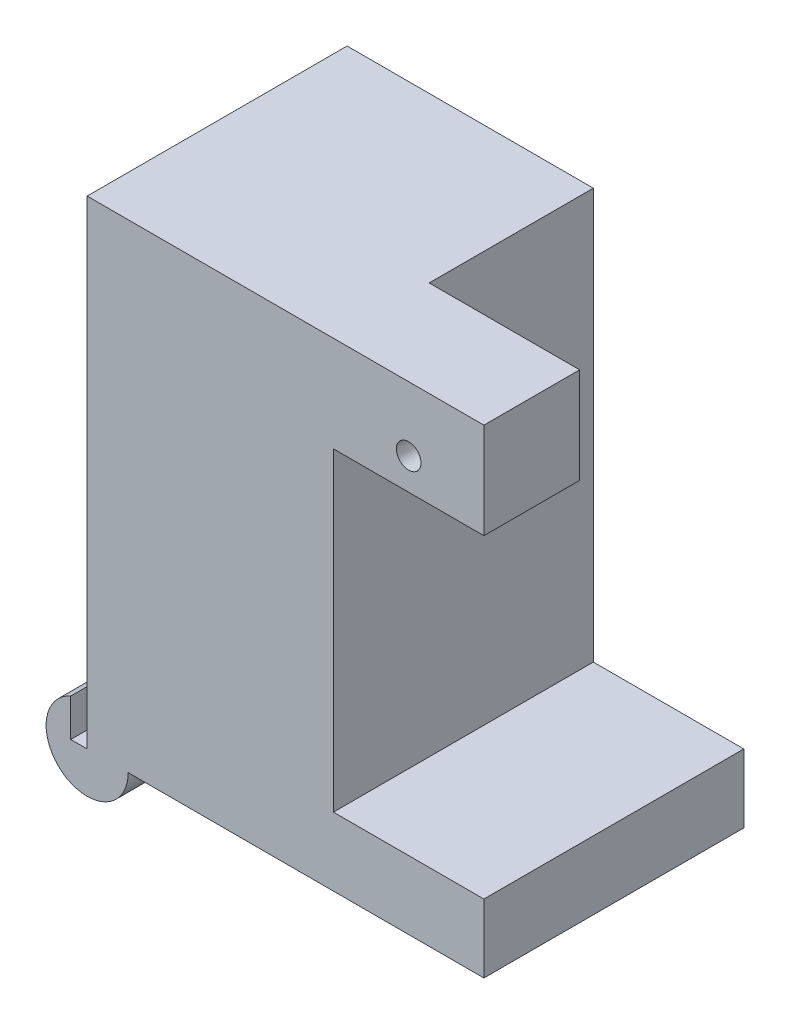
ISO-10303-21;
HEADER;
FILE_DESCRIPTION(('STEP AP214'),'2;1');
FILE_NAME('part.step','',(''),(''),'','','');
FILE_SCHEMA(('AUTOMOTIVE_DESIGN { 1 0 10303 214 1 1 1 1 }'));
ENDSEC;
DATA;
#1=APPLICATION_CONTEXT('core data for automotive mechanical design processes');
#2=APPLICATION_PROTOCOL_DEFINITION('international standard','automotive_design',2000,#1);
#3=PRODUCT_CONTEXT('',#1,'mechanical');
#4=PRODUCT('Part','Part','',(#3));
#5=PRODUCT_RELATED_PRODUCT_CATEGORY('part','',(#4));
#6=PRODUCT_DEFINITION_FORMATION('','',#4);
#7=PRODUCT_DEFINITION_CONTEXT('part definition',#1,'design');
#8=PRODUCT_DEFINITION('design','',#6,#7);
#9=PRODUCT_DEFINITION_SHAPE('','',#8);
#10=(LENGTH_UNIT() NAMED_UNIT(*) SI_UNIT(.MILLI.,.METRE.));
#11=(NAMED_UNIT(*) PLANE_ANGLE_UNIT() SI_UNIT($,.RADIAN.));
#12=(NAMED_UNIT(*) SI_UNIT($,.STERADIAN.) SOLID_ANGLE_UNIT());
#13=UNCERTAINTY_MEASURE_WITH_UNIT(LENGTH_MEASURE(1.E-05),#10,'distance_accuracy_value','');
#14=(GEOMETRIC_REPRESENTATION_CONTEXT(3) GLOBAL_UNCERTAINTY_ASSIGNED_CONTEXT((#13)) GLOBAL_UNIT_ASSIGNED_CONTEXT((#10,
#11,#12)) REPRESENTATION_CONTEXT('',''));
#15=CARTESIAN_POINT('',(0.,0.,0.));
#16=DIRECTION('',(0.,0.,1.));
#17=DIRECTION('',(1.,0.,0.));
#18=AXIS2_PLACEMENT_3D('',#15,#16,#17);
#19=CARTESIAN_POINT('',(-10.3061538100993,0.,-7.94382972657588));
#20=DIRECTION('',(0.,0.,-1.));
#21=DIRECTION('',(-1.,0.,0.));
#22=AXIS2_PLACEMENT_3D('',#19,#20,#21);
#23=CYLINDRICAL_SURFACE('',#22,3.);
#24=DIRECTION('',(0.,0.,-1.));
#25=VECTOR('',#24,1.);
#26=CARTESIAN_POINT('',(-11.5061538100993,2.7495454169735,-7.94382972657588));
#27=LINE('',#26,#25);
#28=CARTESIAN_POINT('',(-11.5061538100993,2.74954541697351,-1.94382972657588));
#29=VERTEX_POINT('',#28);
#30=CARTESIAN_POINT('',(-11.5061538100993,2.7495454169735,11.0561702734241));
#31=VERTEX_POINT('',#30);
#32=EDGE_CURVE('E136',#29,#31,#27,.F.);
#33=ORIENTED_EDGE('',*,*,#32,.F.);
#34=CARTESIAN_POINT('',(-10.3061538100993,0.,-1.94382972657588));
#35=DIRECTION('',(0.,0.,-1.));
#36=DIRECTION('',(-1.,0.,0.));
#37=AXIS2_PLACEMENT_3D('',#34,#35,#36);
#38=CIRCLE('',#37,3.);
#39=CARTESIAN_POINT('',(-7.30615381009931,0.,-1.94382972657588));
#40=VERTEX_POINT('',#39);
#41=EDGE_CURVE('E243',#29,#40,#38,.F.);
#42=ORIENTED_EDGE('',*,*,#41,.T.);
#43=DIRECTION('',(0.,0.,-1.));
#44=VECTOR('',#43,1.);
#45=CARTESIAN_POINT('',(-7.30615381009931,0.,-7.94382972657588));
#46=LINE('',#45,#44);
#47=CARTESIAN_POINT('',(-7.30615381009931,0.,11.0561702734241));
#48=VERTEX_POINT('',#47);
#49=EDGE_CURVE('E241',#48,#40,#46,.T.);
#50=ORIENTED_EDGE('',*,*,#49,.F.);
#51=CARTESIAN_POINT('',(-10.3061538100993,0.,11.0561702734241));
#52=DIRECTION('',(0.,0.,-1.));
#53=DIRECTION('',(-1.,0.,0.));
#54=AXIS2_PLACEMENT_3D('',#51,#52,#53);
#55=CIRCLE('',#54,3.);
#56=EDGE_CURVE('E157',#48,#31,#55,.T.);
#57=ORIENTED_EDGE('',*,*,#56,.T.);
#58=EDGE_LOOP('',(#33,#42,#50,#57));
#59=FACE_BOUND('',#58,.T.);
#60=ADVANCED_FACE('F33',(#59),#23,.T.);
#61=CARTESIAN_POINT('',(-10.3061538100993,35.,-7.94382972657588));
#62=DIRECTION('',(0.,0.,1.));
#63=DIRECTION('',(1.,0.,0.));
#64=AXIS2_PLACEMENT_3D('',#61,#62,#63);
#65=PLANE('',#64);
#66=DIRECTION('',(-1.,0.,0.));
#67=VECTOR('',#66,1.);
#68=CARTESIAN_POINT('',(-10.3061538100993,0.,-7.94382972657588));
#69=LINE('',#68,#67);
#70=CARTESIAN_POINT('',(18.6938461899007,0.,-7.94382972657588));
#71=VERTEX_POINT('',#70);
#72=CARTESIAN_POINT('',(-10.3061538100993,0.,-7.94382972657587));
#73=VERTEX_POINT('',#72);
#74=EDGE_CURVE('E225',#71,#73,#69,.T.);
#75=ORIENTED_EDGE('',*,*,#74,.T.);
#76=DIRECTION('',(0.,-1.,0.));
#77=VECTOR('',#76,1.);
#78=CARTESIAN_POINT('',(-10.3061538100993,35.,-7.94382972657588));
#79=LINE('',#78,#77);
#80=CARTESIAN_POINT('',(-10.3061538100993,35.,-7.94382972657588));
#81=VERTEX_POINT('',#80);
#82=EDGE_CURVE('E218',#81,#73,#79,.T.);
#83=ORIENTED_EDGE('',*,*,#82,.F.);
#84=DIRECTION('',(-1.,0.,0.));
#85=VECTOR('',#84,1.);
#86=CARTESIAN_POINT('',(-10.3061538100993,35.,-7.94382972657588));
#87=LINE('',#86,#85);
#88=CARTESIAN_POINT('',(7.69384618990069,35.,-7.94382972657588));
#89=VERTEX_POINT('',#88);
#90=EDGE_CURVE('E224',#89,#81,#87,.T.);
#91=ORIENTED_EDGE('',*,*,#90,.F.);
#92=DIRECTION('',(0.,-1.,0.));
#93=VECTOR('',#92,1.);
#94=CARTESIAN_POINT('',(7.69384618990069,35.,-7.94382972657588));
#95=LINE('',#94,#93);
#96=CARTESIAN_POINT('',(7.69384618990069,5.,-7.94382972657588));
#97=VERTEX_POINT('',#96);
#98=EDGE_CURVE('E214',#89,#97,#95,.T.);
#99=ORIENTED_EDGE('',*,*,#98,.T.);
#100=DIRECTION('',(-1.,0.,0.));
#101=VECTOR('',#100,1.);
#102=CARTESIAN_POINT('',(18.6938461899007,5.,-7.94382972657588));
#103=LINE('',#102,#101);
#104=CARTESIAN_POINT('',(18.6938461899007,5.,-7.94382972657588));
#105=VERTEX_POINT('',#104);
#106=EDGE_CURVE('E206',#105,#97,#103,.T.);
#107=ORIENTED_EDGE('',*,*,#106,.F.);
#108=DIRECTION('',(0.,1.,0.));
#109=VECTOR('',#108,1.);
#110=CARTESIAN_POINT('',(18.6938461899007,0.,-7.94382972657588));
#111=LINE('',#110,#109);
#112=EDGE_CURVE('E184',#71,#105,#111,.T.);
#113=ORIENTED_EDGE('',*,*,#112,.F.);
#114=EDGE_LOOP('',(#75,#83,#91,#99,#107,#113));
#115=FACE_BOUND('',#114,.T.);
#116=ADVANCED_FACE('F264',(#115),#65,.F.);
#117=CARTESIAN_POINT('',(0.,0.,0.));
#118=DIRECTION('',(0.,1.,0.));
#119=DIRECTION('',(0.,0.,1.));
#120=AXIS2_PLACEMENT_3D('',#117,#118,#119);
#121=PLANE('',#120);
#122=DIRECTION('',(0.,0.,1.));
#123=VECTOR('',#122,1.);
#124=CARTESIAN_POINT('',(-10.3061538100993,0.,-7.94382972657587));
#125=LINE('',#124,#123);
#126=CARTESIAN_POINT('',(-10.3061538100993,0.,-1.94382972657588));
#127=VERTEX_POINT('',#126);
#128=EDGE_CURVE('E151',#73,#127,#125,.T.);
#129=ORIENTED_EDGE('',*,*,#128,.F.);
#130=ORIENTED_EDGE('',*,*,#74,.F.);
#131=DIRECTION('',(0.,0.,-1.));
#132=VECTOR('',#131,1.);
#133=CARTESIAN_POINT('',(18.6938461899007,0.,-7.94382972657588));
#134=LINE('',#133,#132);
#135=CARTESIAN_POINT('',(18.6938461899007,0.,11.0561702734241));
#136=VERTEX_POINT('',#135);
#137=EDGE_CURVE('E192',#136,#71,#134,.T.);
#138=ORIENTED_EDGE('',*,*,#137,.F.);
#139=DIRECTION('',(1.,0.,0.));
#140=VECTOR('',#139,1.);
#141=CARTESIAN_POINT('',(-10.3061538100993,0.,11.0561702734241));
#142=LINE('',#141,#140);
#143=EDGE_CURVE('E211',#48,#136,#142,.T.);
#144=ORIENTED_EDGE('',*,*,#143,.F.);
#145=ORIENTED_EDGE('',*,*,#49,.T.);
#146=DIRECTION('',(-1.,0.,0.));
#147=VECTOR('',#146,1.);
#148=CARTESIAN_POINT('',(18.6938461899007,0.,-1.94382972657588));
#149=LINE('',#148,#147);
#150=EDGE_CURVE('E154',#40,#127,#149,.T.);
#151=ORIENTED_EDGE('',*,*,#150,.T.);
#152=EDGE_LOOP('',(#129,#130,#138,#144,#145,#151));
#153=FACE_BOUND('',#152,.T.);
#154=ADVANCED_FACE('F261',(#153),#121,.F.);
#155=CARTESIAN_POINT('',(7.69384618990069,35.,-7.94382972657588));
#156=DIRECTION('',(-1.,0.,0.));
#157=DIRECTION('',(0.,0.,1.));
#158=AXIS2_PLACEMENT_3D('',#155,#156,#157);
#159=PLANE('',#158);
#160=DIRECTION('',(0.,0.,-1.));
#161=VECTOR('',#160,1.);
#162=CARTESIAN_POINT('',(7.69384618990069,28.,11.0561702734241));
#163=LINE('',#162,#161);
#164=CARTESIAN_POINT('',(7.69384618990069,28.,11.0561702734241));
#165=VERTEX_POINT('',#164);
#166=CARTESIAN_POINT('',(7.69384618990069,28.,4.05617027342412));
#167=VERTEX_POINT('',#166);
#168=EDGE_CURVE('E170',#165,#167,#163,.T.);
#169=ORIENTED_EDGE('',*,*,#168,.F.);
#170=DIRECTION('',(0.,-1.,0.));
#171=VECTOR('',#170,1.);
#172=CARTESIAN_POINT('',(7.69384618990069,35.,11.0561702734241));
#173=LINE('',#172,#171);
#174=CARTESIAN_POINT('',(7.69384618990069,5.,11.0561702734241));
#175=VERTEX_POINT('',#174);
#176=EDGE_CURVE('E217',#165,#175,#173,.T.);
#177=ORIENTED_EDGE('',*,*,#176,.T.);
#178=DIRECTION('',(0.,0.,1.));
#179=VECTOR('',#178,1.);
#180=CARTESIAN_POINT('',(7.69384618990069,5.,-7.94382972657588));
#181=LINE('',#180,#179);
#182=EDGE_CURVE('E183',#97,#175,#181,.T.);
#183=ORIENTED_EDGE('',*,*,#182,.F.);
#184=ORIENTED_EDGE('',*,*,#98,.F.);
#185=DIRECTION('',(0.,0.,1.));
#186=VECTOR('',#185,1.);
#187=CARTESIAN_POINT('',(7.69384618990069,35.,4.05617027342412));
#188=LINE('',#187,#186);
#189=CARTESIAN_POINT('',(7.69384618990069,35.,4.05617027342413));
#190=VERTEX_POINT('',#189);
#191=EDGE_CURVE('E161',#89,#190,#188,.T.);
#192=ORIENTED_EDGE('',*,*,#191,.T.);
#193=DIRECTION('',(0.,-1.,0.));
#194=VECTOR('',#193,1.);
#195=CARTESIAN_POINT('',(7.69384618990069,35.,4.05617027342412));
#196=LINE('',#195,#194);
#197=EDGE_CURVE('E162',#190,#167,#196,.T.);
#198=ORIENTED_EDGE('',*,*,#197,.T.);
#199=EDGE_LOOP('',(#169,#177,#183,#184,#192,#198));
#200=FACE_BOUND('',#199,.T.);
#201=ADVANCED_FACE('F248',(#200),#159,.F.);
#202=CARTESIAN_POINT('',(-10.3061538100993,35.,-7.94382972657588));
#203=DIRECTION('',(1.,0.,0.));
#204=DIRECTION('',(0.,0.,-1.));
#205=AXIS2_PLACEMENT_3D('',#202,#203,#204);
#206=PLANE('',#205);
#207=CARTESIAN_POINT('',(-10.3061538100993,4.,-3.94382972657588));
#208=DIRECTION('',(-1.,0.,0.));
#209=DIRECTION('',(0.,0.,1.));
#210=AXIS2_PLACEMENT_3D('',#207,#208,#209);
#211=CIRCLE('',#210,1.4);
#212=CARTESIAN_POINT('',(-10.3061538100993,4.,-2.54382972657588));
#213=VERTEX_POINT('',#212);
#214=EDGE_CURVE('E299',#213,#213,#211,.T.);
#215=ORIENTED_EDGE('',*,*,#214,.F.);
#216=EDGE_LOOP('',(#215));
#217=FACE_BOUND('',#216,.T.);
#218=DIRECTION('',(0.,0.,1.));
#219=VECTOR('',#218,1.);
#220=CARTESIAN_POINT('',(-10.3061538100993,0.,11.0561702734241));
#221=LINE('',#220,#219);
#222=CARTESIAN_POINT('',(-10.3061538100993,0.,11.0561702734241));
#223=VERTEX_POINT('',#222);
#224=EDGE_CURVE('E49',#127,#223,#221,.T.);
#225=ORIENTED_EDGE('',*,*,#224,.T.);
#226=DIRECTION('',(0.,-1.,0.));
#227=VECTOR('',#226,1.);
#228=CARTESIAN_POINT('',(-10.3061538100993,35.,11.0561702734241));
#229=LINE('',#228,#227);
#230=CARTESIAN_POINT('',(-10.3061538100993,35.,11.0561702734241));
#231=VERTEX_POINT('',#230);
#232=EDGE_CURVE('E145',#231,#223,#229,.T.);
#233=ORIENTED_EDGE('',*,*,#232,.F.);
#234=DIRECTION('',(0.,0.,1.));
#235=VECTOR('',#234,1.);
#236=CARTESIAN_POINT('',(-10.3061538100993,35.,-7.94382972657588));
#237=LINE('',#236,#235);
#238=EDGE_CURVE('E197',#81,#231,#237,.T.);
#239=ORIENTED_EDGE('',*,*,#238,.F.);
#240=ORIENTED_EDGE('',*,*,#82,.T.);
#241=ORIENTED_EDGE('',*,*,#128,.T.);
#242=EDGE_LOOP('',(#225,#233,#239,#240,#241));
#243=FACE_BOUND('',#242,.T.);
#244=ADVANCED_FACE('F35',(#217,#243),#206,.F.);
#245=CARTESIAN_POINT('',(-10.3061538100993,35.,11.0561702734241));
#246=DIRECTION('',(0.,0.,-1.));
#247=DIRECTION('',(-1.,0.,0.));
#248=AXIS2_PLACEMENT_3D('',#245,#246,#247);
#249=PLANE('',#248);
#250=CARTESIAN_POINT('',(13.1938461899007,30.3,11.0561702734241));
#251=DIRECTION('',(0.,0.,1.));
#252=DIRECTION('',(1.,0.,0.));
#253=AXIS2_PLACEMENT_3D('',#250,#251,#252);
#254=CIRCLE('',#253,0.900000000000002);
#255=CARTESIAN_POINT('',(14.0938461899007,30.3,11.0561702734241));
#256=VERTEX_POINT('',#255);
#257=EDGE_CURVE('E300',#256,#256,#254,.T.);
#258=ORIENTED_EDGE('',*,*,#257,.F.);
#259=EDGE_LOOP('',(#258));
#260=FACE_BOUND('',#259,.T.);
#261=ORIENTED_EDGE('',*,*,#232,.T.);
#262=DIRECTION('',(-1.,0.,0.));
#263=VECTOR('',#262,1.);
#264=CARTESIAN_POINT('',(-10.3061538100993,0.,11.0561702734241));
#265=LINE('',#264,#263);
#266=CARTESIAN_POINT('',(-11.5061538100993,0.,11.0561702734241));
#267=VERTEX_POINT('',#266);
#268=EDGE_CURVE('E128',#223,#267,#265,.T.);
#269=ORIENTED_EDGE('',*,*,#268,.T.);
#270=DIRECTION('',(0.,1.,0.));
#271=VECTOR('',#270,1.);
#272=CARTESIAN_POINT('',(-11.5061538100993,-19.0378570222596,11.0561702734241));
#273=LINE('',#272,#271);
#274=EDGE_CURVE('E131',#267,#31,#273,.T.);
#275=ORIENTED_EDGE('',*,*,#274,.T.);
#276=ORIENTED_EDGE('',*,*,#56,.F.);
#277=ORIENTED_EDGE('',*,*,#143,.T.);
#278=DIRECTION('',(0.,-1.,0.));
#279=VECTOR('',#278,1.);
#280=CARTESIAN_POINT('',(18.6938461899007,0.,11.0561702734241));
#281=LINE('',#280,#279);
#282=CARTESIAN_POINT('',(18.6938461899007,5.,11.0561702734241));
#283=VERTEX_POINT('',#282);
#284=EDGE_CURVE('E189',#283,#136,#281,.T.);
#285=ORIENTED_EDGE('',*,*,#284,.F.);
#286=DIRECTION('',(-1.,0.,0.));
#287=VECTOR('',#286,1.);
#288=CARTESIAN_POINT('',(18.6938461899007,5.,11.0561702734241));
#289=LINE('',#288,#287);
#290=EDGE_CURVE('E194',#283,#175,#289,.T.);
#291=ORIENTED_EDGE('',*,*,#290,.T.);
#292=ORIENTED_EDGE('',*,*,#176,.F.);
#293=DIRECTION('',(-1.,0.,0.));
#294=VECTOR('',#293,1.);
#295=CARTESIAN_POINT('',(18.6938461899007,28.,11.0561702734241));
#296=LINE('',#295,#294);
#297=CARTESIAN_POINT('',(18.6938461899007,28.,11.0561702734241));
#298=VERTEX_POINT('',#297);
#299=EDGE_CURVE('E179',#298,#165,#296,.T.);
#300=ORIENTED_EDGE('',*,*,#299,.F.);
#301=DIRECTION('',(0.,-1.,0.));
#302=VECTOR('',#301,1.);
#303=CARTESIAN_POINT('',(18.6938461899007,35.,11.0561702734241));
#304=LINE('',#303,#302);
#305=CARTESIAN_POINT('',(18.6938461899007,35.,11.0561702734241));
#306=VERTEX_POINT('',#305);
#307=EDGE_CURVE('E171',#306,#298,#304,.T.);
#308=ORIENTED_EDGE('',*,*,#307,.F.);
#309=DIRECTION('',(1.,0.,0.));
#310=VECTOR('',#309,1.);
#311=CARTESIAN_POINT('',(-10.3061538100993,35.,11.0561702734241));
#312=LINE('',#311,#310);
#313=EDGE_CURVE('E229',#231,#306,#312,.T.);
#314=ORIENTED_EDGE('',*,*,#313,.F.);
#315=EDGE_LOOP('',(#261,#269,#275,#276,#277,#285,#291,#292,#300,#308,#314));
#316=FACE_BOUND('',#315,.T.);
#317=ADVANCED_FACE('F142',(#260,#316),#249,.F.);
#318=CARTESIAN_POINT('',(0.,35.,0.));
#319=DIRECTION('',(0.,1.,0.));
#320=DIRECTION('',(0.,0.,1.));
#321=AXIS2_PLACEMENT_3D('',#318,#319,#320);
#322=PLANE('',#321);
#323=ORIENTED_EDGE('',*,*,#191,.F.);
#324=ORIENTED_EDGE('',*,*,#90,.T.);
#325=ORIENTED_EDGE('',*,*,#238,.T.);
#326=ORIENTED_EDGE('',*,*,#313,.T.);
#327=DIRECTION('',(0.,0.,1.));
#328=VECTOR('',#327,1.);
#329=CARTESIAN_POINT('',(18.6938461899007,35.,11.0561702734241));
#330=LINE('',#329,#328);
#331=CARTESIAN_POINT('',(18.6938461899007,35.,4.05617027342412));
#332=VERTEX_POINT('',#331);
#333=EDGE_CURVE('E177',#332,#306,#330,.T.);
#334=ORIENTED_EDGE('',*,*,#333,.F.);
#335=DIRECTION('',(1.,0.,0.));
#336=VECTOR('',#335,1.);
#337=CARTESIAN_POINT('',(-6.19859779954911,35.,4.05617027342413));
#338=LINE('',#337,#336);
#339=EDGE_CURVE('E57',#190,#332,#338,.T.);
#340=ORIENTED_EDGE('',*,*,#339,.F.);
#341=EDGE_LOOP('',(#323,#324,#325,#326,#334,#340));
#342=FACE_BOUND('',#341,.T.);
#343=ADVANCED_FACE('F236',(#342),#322,.T.);
#344=CARTESIAN_POINT('',(18.6938461899007,5.,-7.94382972657588));
#345=DIRECTION('',(0.,-1.,0.));
#346=DIRECTION('',(0.,0.,-1.));
#347=AXIS2_PLACEMENT_3D('',#344,#345,#346);
#348=PLANE('',#347);
#349=ORIENTED_EDGE('',*,*,#182,.T.);
#350=ORIENTED_EDGE('',*,*,#290,.F.);
#351=DIRECTION('',(0.,0.,1.));
#352=VECTOR('',#351,1.);
#353=CARTESIAN_POINT('',(18.6938461899007,5.,-7.94382972657588));
#354=LINE('',#353,#352);
#355=EDGE_CURVE('E187',#105,#283,#354,.T.);
#356=ORIENTED_EDGE('',*,*,#355,.F.);
#357=ORIENTED_EDGE('',*,*,#106,.T.);
#358=EDGE_LOOP('',(#349,#350,#356,#357));
#359=FACE_BOUND('',#358,.T.);
#360=ADVANCED_FACE('F251',(#359),#348,.F.);
#361=CARTESIAN_POINT('',(18.6938461899007,0.,0.));
#362=DIRECTION('',(1.,0.,0.));
#363=DIRECTION('',(0.,0.,-1.));
#364=AXIS2_PLACEMENT_3D('',#361,#362,#363);
#365=PLANE('',#364);
#366=ORIENTED_EDGE('',*,*,#112,.T.);
#367=ORIENTED_EDGE('',*,*,#355,.T.);
#368=ORIENTED_EDGE('',*,*,#284,.T.);
#369=ORIENTED_EDGE('',*,*,#137,.T.);
#370=EDGE_LOOP('',(#366,#367,#368,#369));
#371=FACE_BOUND('',#370,.T.);
#372=ADVANCED_FACE('F257',(#371),#365,.T.);
#373=CARTESIAN_POINT('',(18.6938461899007,28.,11.0561702734241));
#374=DIRECTION('',(0.,1.,0.));
#375=DIRECTION('',(0.,0.,1.));
#376=AXIS2_PLACEMENT_3D('',#373,#374,#375);
#377=PLANE('',#376);
#378=ORIENTED_EDGE('',*,*,#168,.T.);
#379=DIRECTION('',(1.,0.,0.));
#380=VECTOR('',#379,1.);
#381=CARTESIAN_POINT('',(-6.19859779954911,28.,4.05617027342412));
#382=LINE('',#381,#380);
#383=CARTESIAN_POINT('',(18.6938461899007,28.,4.05617027342412));
#384=VERTEX_POINT('',#383);
#385=EDGE_CURVE('E164',#167,#384,#382,.T.);
#386=ORIENTED_EDGE('',*,*,#385,.T.);
#387=DIRECTION('',(0.,0.,-1.));
#388=VECTOR('',#387,1.);
#389=CARTESIAN_POINT('',(18.6938461899007,28.,11.0561702734241));
#390=LINE('',#389,#388);
#391=EDGE_CURVE('E174',#298,#384,#390,.T.);
#392=ORIENTED_EDGE('',*,*,#391,.F.);
#393=ORIENTED_EDGE('',*,*,#299,.T.);
#394=EDGE_LOOP('',(#378,#386,#392,#393));
#395=FACE_BOUND('',#394,.T.);
#396=ADVANCED_FACE('F270',(#395),#377,.F.);
#397=CARTESIAN_POINT('',(18.6938461899007,0.,0.));
#398=DIRECTION('',(1.,0.,0.));
#399=DIRECTION('',(0.,0.,-1.));
#400=AXIS2_PLACEMENT_3D('',#397,#398,#399);
#401=PLANE('',#400);
#402=DIRECTION('',(0.,-1.,0.));
#403=VECTOR('',#402,1.);
#404=CARTESIAN_POINT('',(18.6938461899007,35.,4.05617027342412));
#405=LINE('',#404,#403);
#406=EDGE_CURVE('E159',#332,#384,#405,.T.);
#407=ORIENTED_EDGE('',*,*,#406,.F.);
#408=ORIENTED_EDGE('',*,*,#333,.T.);
#409=ORIENTED_EDGE('',*,*,#307,.T.);
#410=ORIENTED_EDGE('',*,*,#391,.T.);
#411=EDGE_LOOP('',(#407,#408,#409,#410));
#412=FACE_BOUND('',#411,.T.);
#413=ADVANCED_FACE('F266',(#412),#401,.T.);
#414=CARTESIAN_POINT('',(-6.19859779954911,35.,4.05617027342413));
#415=DIRECTION('',(0.,0.,1.));
#416=DIRECTION('',(1.,0.,0.));
#417=AXIS2_PLACEMENT_3D('',#414,#415,#416);
#418=PLANE('',#417);
#419=CARTESIAN_POINT('',(13.1938461899007,30.3,4.05617027342412));
#420=DIRECTION('',(0.,0.,1.));
#421=DIRECTION('',(1.,0.,0.));
#422=AXIS2_PLACEMENT_3D('',#419,#420,#421);
#423=CIRCLE('',#422,0.900000000000002);
#424=CARTESIAN_POINT('',(14.0938461899007,30.3,4.05617027342412));
#425=VERTEX_POINT('',#424);
#426=EDGE_CURVE('E37',#425,#425,#423,.T.);
#427=ORIENTED_EDGE('',*,*,#426,.T.);
#428=EDGE_LOOP('',(#427));
#429=FACE_BOUND('',#428,.T.);
#430=ORIENTED_EDGE('',*,*,#339,.T.);
#431=ORIENTED_EDGE('',*,*,#406,.T.);
#432=ORIENTED_EDGE('',*,*,#385,.F.);
#433=ORIENTED_EDGE('',*,*,#197,.F.);
#434=EDGE_LOOP('',(#430,#431,#432,#433));
#435=FACE_BOUND('',#434,.T.);
#436=ADVANCED_FACE('F268',(#429,#435),#418,.F.);
#437=CARTESIAN_POINT('',(18.6938461899007,-3.,-1.94382972657588));
#438=DIRECTION('',(0.,0.,-1.));
#439=DIRECTION('',(-1.,0.,0.));
#440=AXIS2_PLACEMENT_3D('',#437,#438,#439);
#441=PLANE('',#440);
#442=DIRECTION('',(0.,1.,0.));
#443=VECTOR('',#442,1.);
#444=CARTESIAN_POINT('',(-11.5061538100993,-3.,-1.94382972657588));
#445=LINE('',#444,#443);
#446=CARTESIAN_POINT('',(-11.5061538100993,0.,-1.94382972657588));
#447=VERTEX_POINT('',#446);
#448=EDGE_CURVE('E11',#447,#29,#445,.T.);
#449=ORIENTED_EDGE('',*,*,#448,.F.);
#450=DIRECTION('',(1.,0.,0.));
#451=VECTOR('',#450,1.);
#452=CARTESIAN_POINT('',(18.6938461899007,0.,-1.94382972657588));
#453=LINE('',#452,#451);
#454=EDGE_CURVE('E42',#447,#127,#453,.T.);
#455=ORIENTED_EDGE('',*,*,#454,.T.);
#456=ORIENTED_EDGE('',*,*,#150,.F.);
#457=ORIENTED_EDGE('',*,*,#41,.F.);
#458=EDGE_LOOP('',(#449,#455,#456,#457));
#459=FACE_BOUND('',#458,.T.);
#460=ADVANCED_FACE('F288',(#459),#441,.T.);
#461=CARTESIAN_POINT('',(-11.5061538100993,-19.0378570222596,11.0561702734241));
#462=DIRECTION('',(-1.,0.,0.));
#463=DIRECTION('',(0.,0.,1.));
#464=AXIS2_PLACEMENT_3D('',#461,#462,#463);
#465=PLANE('',#464);
#466=ORIENTED_EDGE('',*,*,#32,.T.);
#467=ORIENTED_EDGE('',*,*,#274,.F.);
#468=DIRECTION('',(0.,0.,-1.));
#469=VECTOR('',#468,1.);
#470=CARTESIAN_POINT('',(-11.5061538100993,0.,11.0561702734241));
#471=LINE('',#470,#469);
#472=EDGE_CURVE('E124',#267,#447,#471,.T.);
#473=ORIENTED_EDGE('',*,*,#472,.T.);
#474=ORIENTED_EDGE('',*,*,#448,.T.);
#475=EDGE_LOOP('',(#466,#467,#473,#474));
#476=FACE_BOUND('',#475,.T.);
#477=ADVANCED_FACE('F134',(#476),#465,.F.);
#478=CARTESIAN_POINT('',(0.,0.,0.));
#479=DIRECTION('',(0.,1.,0.));
#480=DIRECTION('',(0.,0.,1.));
#481=AXIS2_PLACEMENT_3D('',#478,#479,#480);
#482=PLANE('',#481);
#483=ORIENTED_EDGE('',*,*,#472,.F.);
#484=ORIENTED_EDGE('',*,*,#268,.F.);
#485=ORIENTED_EDGE('',*,*,#224,.F.);
#486=ORIENTED_EDGE('',*,*,#454,.F.);
#487=EDGE_LOOP('',(#483,#484,#485,#486));
#488=FACE_BOUND('',#487,.T.);
#489=ADVANCED_FACE('F126',(#488),#482,.T.);
#490=CARTESIAN_POINT('',(-5.30615381009931,4.,-3.94382972657588));
#491=DIRECTION('',(-1.,0.,0.));
#492=DIRECTION('',(0.,0.,1.));
#493=AXIS2_PLACEMENT_3D('',#490,#491,#492);
#494=CYLINDRICAL_SURFACE('',#493,1.4);
#495=CARTESIAN_POINT('',(-5.30615381009931,4.,-3.94382972657588));
#496=DIRECTION('',(-1.,0.,0.));
#497=DIRECTION('',(0.,0.,1.));
#498=AXIS2_PLACEMENT_3D('',#495,#496,#497);
#499=CIRCLE('',#498,1.4);
#500=CARTESIAN_POINT('',(-5.30615381009931,4.,-2.54382972657588));
#501=VERTEX_POINT('',#500);
#502=EDGE_CURVE('E140',#501,#501,#499,.T.);
#503=ORIENTED_EDGE('',*,*,#502,.F.);
#504=EDGE_LOOP('',(#503));
#505=FACE_BOUND('',#504,.T.);
#506=ORIENTED_EDGE('',*,*,#214,.T.);
#507=EDGE_LOOP('',(#506));
#508=FACE_BOUND('',#507,.T.);
#509=ADVANCED_FACE('F312',(#505,#508),#494,.F.);
#510=CARTESIAN_POINT('',(-5.30615381009931,4.,-3.94382972657588));
#511=DIRECTION('',(-1.,0.,0.));
#512=DIRECTION('',(0.,0.,1.));
#513=AXIS2_PLACEMENT_3D('',#510,#511,#512);
#514=PLANE('',#513);
#515=ORIENTED_EDGE('',*,*,#502,.T.);
#516=EDGE_LOOP('',(#515));
#517=FACE_BOUND('',#516,.T.);
#518=ADVANCED_FACE('F310',(#517),#514,.T.);
#519=CARTESIAN_POINT('',(13.1938461899007,30.3,-7.94387972657587));
#520=DIRECTION('',(0.,0.,1.));
#521=DIRECTION('',(1.,0.,0.));
#522=AXIS2_PLACEMENT_3D('',#519,#520,#521);
#523=CYLINDRICAL_SURFACE('',#522,0.900000000000002);
#524=ORIENTED_EDGE('',*,*,#257,.T.);
#525=EDGE_LOOP('',(#524));
#526=FACE_BOUND('',#525,.T.);
#527=ORIENTED_EDGE('',*,*,#426,.F.);
#528=EDGE_LOOP('',(#527));
#529=FACE_BOUND('',#528,.T.);
#530=ADVANCED_FACE('F412',(#526,#529),#523,.F.);
#531=CLOSED_SHELL('',(#60,#116,#154,#201,#244,#317,#343,#360,#372,#396,#413,#436,#460,#477,#489,
#509,#518,#530));
#532=MANIFOLD_SOLID_BREP('B2',#531);
#533=ADVANCED_BREP_SHAPE_REPRESENTATION('',(#18,#532),#14);
#534=SHAPE_DEFINITION_REPRESENTATION(#9,#533);
ENDSEC;
END-ISO-10303-21;
